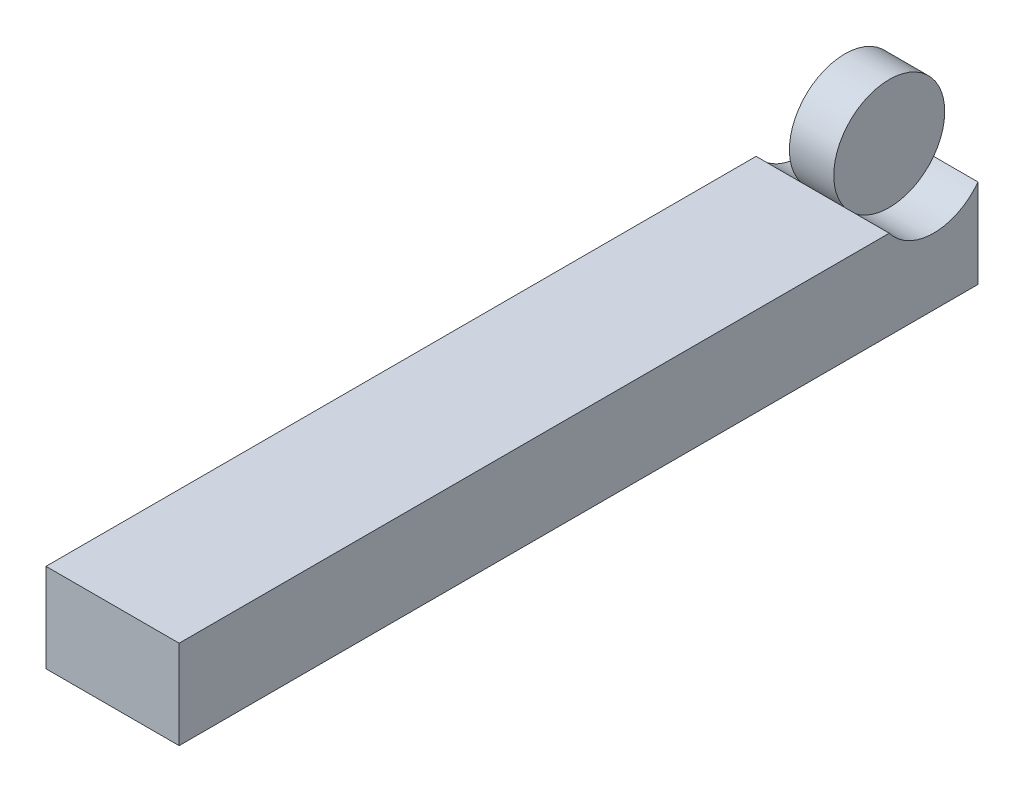
ISO-10303-21;
HEADER;
FILE_DESCRIPTION(('STEP AP214'),'2;1');
FILE_NAME('part.step','',(''),(''),'','','');
FILE_SCHEMA(('AUTOMOTIVE_DESIGN { 1 0 10303 214 1 1 1 1 }'));
ENDSEC;
DATA;
#1=APPLICATION_CONTEXT('core data for automotive mechanical design processes');
#2=APPLICATION_PROTOCOL_DEFINITION('international standard','automotive_design',2000,#1);
#3=PRODUCT_CONTEXT('',#1,'mechanical');
#4=PRODUCT('Part','Part','',(#3));
#5=PRODUCT_RELATED_PRODUCT_CATEGORY('part','',(#4));
#6=PRODUCT_DEFINITION_FORMATION('','',#4);
#7=PRODUCT_DEFINITION_CONTEXT('part definition',#1,'design');
#8=PRODUCT_DEFINITION('design','',#6,#7);
#9=PRODUCT_DEFINITION_SHAPE('','',#8);
#10=(LENGTH_UNIT() NAMED_UNIT(*) SI_UNIT(.MILLI.,.METRE.));
#11=(NAMED_UNIT(*) PLANE_ANGLE_UNIT() SI_UNIT($,.RADIAN.));
#12=(NAMED_UNIT(*) SI_UNIT($,.STERADIAN.) SOLID_ANGLE_UNIT());
#13=UNCERTAINTY_MEASURE_WITH_UNIT(LENGTH_MEASURE(1.E-05),#10,'distance_accuracy_value','');
#14=(GEOMETRIC_REPRESENTATION_CONTEXT(3) GLOBAL_UNCERTAINTY_ASSIGNED_CONTEXT((#13)) GLOBAL_UNIT_ASSIGNED_CONTEXT((#10,
#11,#12)) REPRESENTATION_CONTEXT('',''));
#15=CARTESIAN_POINT('',(0.,0.,0.));
#16=DIRECTION('',(0.,0.,1.));
#17=DIRECTION('',(1.,0.,0.));
#18=AXIS2_PLACEMENT_3D('',#15,#16,#17);
#19=CARTESIAN_POINT('',(-30.,27.5,-170.));
#20=DIRECTION('',(1.,0.,0.));
#21=DIRECTION('',(0.,0.,-1.));
#22=AXIS2_PLACEMENT_3D('',#19,#20,#21);
#23=CYLINDRICAL_SURFACE('',#22,12.5);
#24=CARTESIAN_POINT('',(-20.,27.5,-170.));
#25=DIRECTION('',(1.,0.,0.));
#26=DIRECTION('',(0.,0.,-1.));
#27=AXIS2_PLACEMENT_3D('',#24,#25,#26);
#28=CIRCLE('',#27,12.5);
#29=CARTESIAN_POINT('',(-20.,20.,-160.));
#30=VERTEX_POINT('',#29);
#31=CARTESIAN_POINT('',(-20.,20.,-180.));
#32=VERTEX_POINT('',#31);
#33=EDGE_CURVE('E59',#30,#32,#28,.T.);
#34=ORIENTED_EDGE('',*,*,#33,.T.);
#35=DIRECTION('',(1.,0.,0.));
#36=VECTOR('',#35,1.);
#37=CARTESIAN_POINT('',(-30.,20.,-180.));
#38=LINE('',#37,#36);
#39=CARTESIAN_POINT('',(-30.,20.,-180.));
#40=VERTEX_POINT('',#39);
#41=EDGE_CURVE('E43',#40,#32,#38,.T.);
#42=ORIENTED_EDGE('',*,*,#41,.F.);
#43=CARTESIAN_POINT('',(-30.,27.5,-170.));
#44=DIRECTION('',(1.,0.,0.));
#45=DIRECTION('',(0.,0.,-1.));
#46=AXIS2_PLACEMENT_3D('',#43,#44,#45);
#47=CIRCLE('',#46,12.5);
#48=CARTESIAN_POINT('',(-30.,20.,-160.));
#49=VERTEX_POINT('',#48);
#50=EDGE_CURVE('E96',#49,#40,#47,.T.);
#51=ORIENTED_EDGE('',*,*,#50,.F.);
#52=DIRECTION('',(1.,0.,0.));
#53=VECTOR('',#52,1.);
#54=CARTESIAN_POINT('',(-30.,20.,-160.));
#55=LINE('',#54,#53);
#56=EDGE_CURVE('E93',#49,#30,#55,.T.);
#57=ORIENTED_EDGE('',*,*,#56,.T.);
#58=EDGE_LOOP('',(#34,#42,#51,#57));
#59=FACE_BOUND('',#58,.T.);
#60=ADVANCED_FACE('F34',(#59),#23,.F.);
#61=CARTESIAN_POINT('',(-30.,0.,0.));
#62=DIRECTION('',(0.,0.,1.));
#63=DIRECTION('',(1.,0.,0.));
#64=AXIS2_PLACEMENT_3D('',#61,#62,#63);
#65=PLANE('',#64);
#66=DIRECTION('',(0.,-1.,0.));
#67=VECTOR('',#66,1.);
#68=CARTESIAN_POINT('',(0.,0.,0.));
#69=LINE('',#68,#67);
#70=CARTESIAN_POINT('',(0.,20.,0.));
#71=VERTEX_POINT('',#70);
#72=CARTESIAN_POINT('',(0.,0.,0.));
#73=VERTEX_POINT('',#72);
#74=EDGE_CURVE('E99',#71,#73,#69,.T.);
#75=ORIENTED_EDGE('',*,*,#74,.F.);
#76=DIRECTION('',(1.,0.,0.));
#77=VECTOR('',#76,1.);
#78=CARTESIAN_POINT('',(-30.,20.,0.));
#79=LINE('',#78,#77);
#80=CARTESIAN_POINT('',(-30.,20.,0.));
#81=VERTEX_POINT('',#80);
#82=EDGE_CURVE('E11',#81,#71,#79,.T.);
#83=ORIENTED_EDGE('',*,*,#82,.F.);
#84=DIRECTION('',(0.,-1.,0.));
#85=VECTOR('',#84,1.);
#86=CARTESIAN_POINT('',(-30.,0.,0.));
#87=LINE('',#86,#85);
#88=CARTESIAN_POINT('',(-30.,0.,0.));
#89=VERTEX_POINT('',#88);
#90=EDGE_CURVE('E126',#81,#89,#87,.T.);
#91=ORIENTED_EDGE('',*,*,#90,.T.);
#92=DIRECTION('',(1.,0.,0.));
#93=VECTOR('',#92,1.);
#94=CARTESIAN_POINT('',(-30.,0.,0.));
#95=LINE('',#94,#93);
#96=EDGE_CURVE('E38',#89,#73,#95,.T.);
#97=ORIENTED_EDGE('',*,*,#96,.T.);
#98=EDGE_LOOP('',(#75,#83,#91,#97));
#99=FACE_BOUND('',#98,.T.);
#100=ADVANCED_FACE('F36',(#99),#65,.T.);
#101=CARTESIAN_POINT('',(-30.,20.,0.));
#102=DIRECTION('',(0.,1.,0.));
#103=DIRECTION('',(0.,0.,1.));
#104=AXIS2_PLACEMENT_3D('',#101,#102,#103);
#105=PLANE('',#104);
#106=ORIENTED_EDGE('',*,*,#56,.F.);
#107=DIRECTION('',(0.,0.,1.));
#108=VECTOR('',#107,1.);
#109=CARTESIAN_POINT('',(-30.,20.,0.));
#110=LINE('',#109,#108);
#111=EDGE_CURVE('E136',#49,#81,#110,.T.);
#112=ORIENTED_EDGE('',*,*,#111,.T.);
#113=ORIENTED_EDGE('',*,*,#82,.T.);
#114=DIRECTION('',(0.,0.,1.));
#115=VECTOR('',#114,1.);
#116=CARTESIAN_POINT('',(0.,20.,0.));
#117=LINE('',#116,#115);
#118=CARTESIAN_POINT('',(0.,20.,-160.));
#119=VERTEX_POINT('',#118);
#120=EDGE_CURVE('E130',#119,#71,#117,.T.);
#121=ORIENTED_EDGE('',*,*,#120,.F.);
#122=CARTESIAN_POINT('',(-10.,20.,-160.));
#123=VERTEX_POINT('',#122);
#124=EDGE_CURVE('E102',#123,#119,#55,.T.);
#125=ORIENTED_EDGE('',*,*,#124,.F.);
#126=EDGE_CURVE('E100',#30,#123,#55,.T.);
#127=ORIENTED_EDGE('',*,*,#126,.F.);
#128=EDGE_LOOP('',(#106,#112,#113,#121,#125,#127));
#129=FACE_BOUND('',#128,.T.);
#130=ADVANCED_FACE('F106',(#129),#105,.T.);
#131=CARTESIAN_POINT('',(-30.,0.,-180.));
#132=DIRECTION('',(0.,0.,-1.));
#133=DIRECTION('',(-1.,0.,0.));
#134=AXIS2_PLACEMENT_3D('',#131,#132,#133);
#135=PLANE('',#134);
#136=DIRECTION('',(0.,1.,0.));
#137=VECTOR('',#136,1.);
#138=CARTESIAN_POINT('',(0.,0.,-180.));
#139=LINE('',#138,#137);
#140=CARTESIAN_POINT('',(0.,0.,-180.));
#141=VERTEX_POINT('',#140);
#142=CARTESIAN_POINT('',(0.,20.,-180.));
#143=VERTEX_POINT('',#142);
#144=EDGE_CURVE('E143',#141,#143,#139,.T.);
#145=ORIENTED_EDGE('',*,*,#144,.F.);
#146=DIRECTION('',(1.,0.,0.));
#147=VECTOR('',#146,1.);
#148=CARTESIAN_POINT('',(-30.,0.,-180.));
#149=LINE('',#148,#147);
#150=CARTESIAN_POINT('',(-30.,0.,-180.));
#151=VERTEX_POINT('',#150);
#152=EDGE_CURVE('E147',#151,#141,#149,.T.);
#153=ORIENTED_EDGE('',*,*,#152,.F.);
#154=DIRECTION('',(0.,1.,0.));
#155=VECTOR('',#154,1.);
#156=CARTESIAN_POINT('',(-30.,0.,-180.));
#157=LINE('',#156,#155);
#158=EDGE_CURVE('E133',#151,#40,#157,.T.);
#159=ORIENTED_EDGE('',*,*,#158,.T.);
#160=ORIENTED_EDGE('',*,*,#41,.T.);
#161=CARTESIAN_POINT('',(-10.,20.,-180.));
#162=VERTEX_POINT('',#161);
#163=EDGE_CURVE('E115',#32,#162,#38,.T.);
#164=ORIENTED_EDGE('',*,*,#163,.T.);
#165=EDGE_CURVE('E51',#162,#143,#38,.T.);
#166=ORIENTED_EDGE('',*,*,#165,.T.);
#167=EDGE_LOOP('',(#145,#153,#159,#160,#164,#166));
#168=FACE_BOUND('',#167,.T.);
#169=ADVANCED_FACE('F164',(#168),#135,.T.);
#170=CARTESIAN_POINT('',(-30.,0.,0.));
#171=DIRECTION('',(0.,-1.,0.));
#172=DIRECTION('',(0.,0.,-1.));
#173=AXIS2_PLACEMENT_3D('',#170,#171,#172);
#174=PLANE('',#173);
#175=DIRECTION('',(0.,0.,-1.));
#176=VECTOR('',#175,1.);
#177=CARTESIAN_POINT('',(0.,0.,0.));
#178=LINE('',#177,#176);
#179=EDGE_CURVE('E140',#73,#141,#178,.T.);
#180=ORIENTED_EDGE('',*,*,#179,.F.);
#181=ORIENTED_EDGE('',*,*,#96,.F.);
#182=DIRECTION('',(0.,0.,-1.));
#183=VECTOR('',#182,1.);
#184=CARTESIAN_POINT('',(-30.,0.,0.));
#185=LINE('',#184,#183);
#186=EDGE_CURVE('E129',#89,#151,#185,.T.);
#187=ORIENTED_EDGE('',*,*,#186,.T.);
#188=ORIENTED_EDGE('',*,*,#152,.T.);
#189=EDGE_LOOP('',(#180,#181,#187,#188));
#190=FACE_BOUND('',#189,.T.);
#191=ADVANCED_FACE('F156',(#190),#174,.T.);
#192=CARTESIAN_POINT('',(-30.,0.,0.));
#193=DIRECTION('',(-1.,0.,0.));
#194=DIRECTION('',(0.,0.,1.));
#195=AXIS2_PLACEMENT_3D('',#192,#193,#194);
#196=PLANE('',#195);
#197=ORIENTED_EDGE('',*,*,#50,.T.);
#198=ORIENTED_EDGE('',*,*,#158,.F.);
#199=ORIENTED_EDGE('',*,*,#186,.F.);
#200=ORIENTED_EDGE('',*,*,#90,.F.);
#201=ORIENTED_EDGE('',*,*,#111,.F.);
#202=EDGE_LOOP('',(#197,#198,#199,#200,#201));
#203=FACE_BOUND('',#202,.T.);
#204=ADVANCED_FACE('F161',(#203),#196,.T.);
#205=CARTESIAN_POINT('',(0.,0.,0.));
#206=DIRECTION('',(-1.,0.,0.));
#207=DIRECTION('',(0.,0.,1.));
#208=AXIS2_PLACEMENT_3D('',#205,#206,#207);
#209=PLANE('',#208);
#210=ORIENTED_EDGE('',*,*,#144,.T.);
#211=CARTESIAN_POINT('',(0.,27.5,-170.));
#212=DIRECTION('',(1.,0.,0.));
#213=DIRECTION('',(0.,0.,-1.));
#214=AXIS2_PLACEMENT_3D('',#211,#212,#213);
#215=CIRCLE('',#214,12.5);
#216=EDGE_CURVE('E124',#119,#143,#215,.T.);
#217=ORIENTED_EDGE('',*,*,#216,.F.);
#218=ORIENTED_EDGE('',*,*,#120,.T.);
#219=ORIENTED_EDGE('',*,*,#74,.T.);
#220=ORIENTED_EDGE('',*,*,#179,.T.);
#221=EDGE_LOOP('',(#210,#217,#218,#219,#220));
#222=FACE_BOUND('',#221,.T.);
#223=ADVANCED_FACE('F158',(#222),#209,.F.);
#224=ORIENTED_EDGE('',*,*,#165,.F.);
#225=CARTESIAN_POINT('',(-10.,27.5,-170.));
#226=DIRECTION('',(1.,0.,0.));
#227=DIRECTION('',(0.,0.,-1.));
#228=AXIS2_PLACEMENT_3D('',#225,#226,#227);
#229=CIRCLE('',#228,12.5);
#230=EDGE_CURVE('E120',#123,#162,#229,.T.);
#231=ORIENTED_EDGE('',*,*,#230,.F.);
#232=ORIENTED_EDGE('',*,*,#124,.T.);
#233=ORIENTED_EDGE('',*,*,#216,.T.);
#234=EDGE_LOOP('',(#224,#231,#232,#233));
#235=FACE_BOUND('',#234,.T.);
#236=ADVANCED_FACE('F165',(#235),#23,.F.);
#237=CARTESIAN_POINT('',(-10.,27.5,-170.));
#238=DIRECTION('',(-1.,0.,0.));
#239=DIRECTION('',(0.,0.,1.));
#240=AXIS2_PLACEMENT_3D('',#237,#238,#239);
#241=CYLINDRICAL_SURFACE('',#240,12.5);
#242=ORIENTED_EDGE('',*,*,#126,.T.);
#243=EDGE_CURVE('E119',#162,#123,#229,.T.);
#244=ORIENTED_EDGE('',*,*,#243,.F.);
#245=ORIENTED_EDGE('',*,*,#163,.F.);
#246=EDGE_CURVE('E113',#32,#30,#28,.T.);
#247=ORIENTED_EDGE('',*,*,#246,.T.);
#248=EDGE_LOOP('',(#242,#244,#245,#247));
#249=FACE_BOUND('',#248,.T.);
#250=ADVANCED_FACE('F114',(#249),#241,.T.);
#251=CARTESIAN_POINT('',(-10.,27.5,-170.));
#252=DIRECTION('',(1.,0.,0.));
#253=DIRECTION('',(0.,0.,-1.));
#254=AXIS2_PLACEMENT_3D('',#251,#252,#253);
#255=PLANE('',#254);
#256=ORIENTED_EDGE('',*,*,#230,.T.);
#257=ORIENTED_EDGE('',*,*,#243,.T.);
#258=EDGE_LOOP('',(#256,#257));
#259=FACE_BOUND('',#258,.T.);
#260=ADVANCED_FACE('F168',(#259),#255,.T.);
#261=CARTESIAN_POINT('',(-20.,27.5,-170.));
#262=DIRECTION('',(1.,0.,0.));
#263=DIRECTION('',(0.,0.,-1.));
#264=AXIS2_PLACEMENT_3D('',#261,#262,#263);
#265=PLANE('',#264);
#266=ORIENTED_EDGE('',*,*,#33,.F.);
#267=ORIENTED_EDGE('',*,*,#246,.F.);
#268=EDGE_LOOP('',(#266,#267));
#269=FACE_BOUND('',#268,.T.);
#270=ADVANCED_FACE('F118',(#269),#265,.F.);
#271=CLOSED_SHELL('',(#60,#100,#130,#169,#191,#204,#223,#236,#250,#260,#270));
#272=MANIFOLD_SOLID_BREP('B2',#271);
#273=ADVANCED_BREP_SHAPE_REPRESENTATION('',(#18,#272),#14);
#274=SHAPE_DEFINITION_REPRESENTATION(#9,#273);
ENDSEC;
END-ISO-10303-21;
